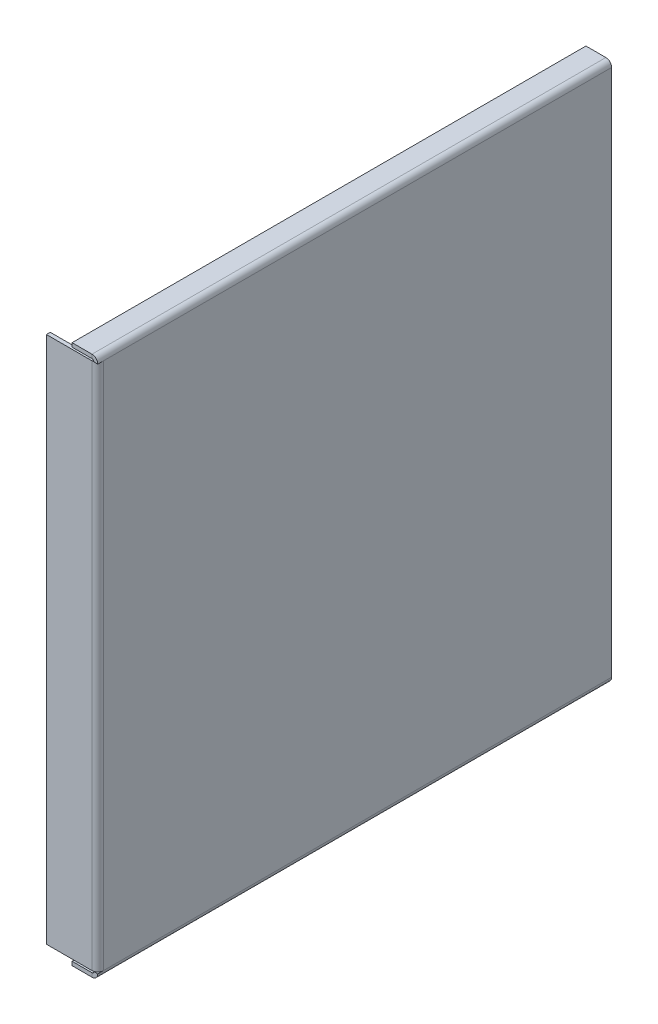
ISO-10303-21;
HEADER;
FILE_DESCRIPTION(('STEP AP214'),'2;1');
FILE_NAME('part.step','',(''),(''),'','','');
FILE_SCHEMA(('AUTOMOTIVE_DESIGN { 1 0 10303 214 1 1 1 1 }'));
ENDSEC;
DATA;
#1=APPLICATION_CONTEXT('core data for automotive mechanical design processes');
#2=APPLICATION_PROTOCOL_DEFINITION('international standard','automotive_design',2000,#1);
#3=PRODUCT_CONTEXT('',#1,'mechanical');
#4=PRODUCT('Part','Part','',(#3));
#5=PRODUCT_RELATED_PRODUCT_CATEGORY('part','',(#4));
#6=PRODUCT_DEFINITION_FORMATION('','',#4);
#7=PRODUCT_DEFINITION_CONTEXT('part definition',#1,'design');
#8=PRODUCT_DEFINITION('design','',#6,#7);
#9=PRODUCT_DEFINITION_SHAPE('','',#8);
#10=(LENGTH_UNIT() NAMED_UNIT(*) SI_UNIT(.MILLI.,.METRE.));
#11=(NAMED_UNIT(*) PLANE_ANGLE_UNIT() SI_UNIT($,.RADIAN.));
#12=(NAMED_UNIT(*) SI_UNIT($,.STERADIAN.) SOLID_ANGLE_UNIT());
#13=UNCERTAINTY_MEASURE_WITH_UNIT(LENGTH_MEASURE(1.E-05),#10,'distance_accuracy_value','');
#14=(GEOMETRIC_REPRESENTATION_CONTEXT(3) GLOBAL_UNCERTAINTY_ASSIGNED_CONTEXT((#13)) GLOBAL_UNIT_ASSIGNED_CONTEXT((#10,
#11,#12)) REPRESENTATION_CONTEXT('',''));
#15=CARTESIAN_POINT('',(0.,0.,0.));
#16=DIRECTION('',(0.,0.,1.));
#17=DIRECTION('',(1.,0.,0.));
#18=AXIS2_PLACEMENT_3D('',#15,#16,#17);
#19=CARTESIAN_POINT('',(0.,207.7634,200.));
#20=DIRECTION('',(0.,-1.,0.));
#21=DIRECTION('',(0.,0.,-1.));
#22=AXIS2_PLACEMENT_3D('',#19,#20,#21);
#23=PLANE('',#22);
#24=DIRECTION('',(0.,0.,-1.));
#25=VECTOR('',#24,1.);
#26=CARTESIAN_POINT('',(0.,207.7634,200.));
#27=LINE('',#26,#25);
#28=CARTESIAN_POINT('',(0.,207.7634,200.));
#29=VERTEX_POINT('',#28);
#30=CARTESIAN_POINT('',(0.,207.7634,199.875223856291));
#31=VERTEX_POINT('',#30);
#32=EDGE_CURVE('E296',#29,#31,#27,.T.);
#33=ORIENTED_EDGE('',*,*,#32,.T.);
#34=CARTESIAN_POINT('',(-0.736600000000004,207.7634,197.7634));
#35=DIRECTION('',(0.,1.,0.));
#36=DIRECTION('',(0.,0.,1.));
#37=AXIS2_PLACEMENT_3D('',#34,#35,#36);
#38=CIRCLE('',#37,2.2366);
#39=CARTESIAN_POINT('',(1.5,207.7634,197.7634));
#40=VERTEX_POINT('',#39);
#41=EDGE_CURVE('E13',#31,#40,#38,.T.);
#42=ORIENTED_EDGE('',*,*,#41,.T.);
#43=DIRECTION('',(0.,0.,-1.));
#44=VECTOR('',#43,1.);
#45=CARTESIAN_POINT('',(1.5,207.7634,0.));
#46=LINE('',#45,#44);
#47=CARTESIAN_POINT('',(1.5,207.7634,200.));
#48=VERTEX_POINT('',#47);
#49=EDGE_CURVE('E299',#48,#40,#46,.T.);
#50=ORIENTED_EDGE('',*,*,#49,.F.);
#51=DIRECTION('',(1.,0.,0.));
#52=VECTOR('',#51,1.);
#53=CARTESIAN_POINT('',(0.,207.7634,200.));
#54=LINE('',#53,#52);
#55=EDGE_CURVE('E409',#29,#48,#54,.T.);
#56=ORIENTED_EDGE('',*,*,#55,.F.);
#57=EDGE_LOOP('',(#33,#42,#50,#56));
#58=FACE_BOUND('',#57,.T.);
#59=ADVANCED_FACE('F99',(#58),#23,.T.);
#60=CARTESIAN_POINT('',(0.,2.23659999999998,197.7634));
#61=DIRECTION('',(0.,1.,0.));
#62=DIRECTION('',(0.,0.,1.));
#63=AXIS2_PLACEMENT_3D('',#60,#61,#62);
#64=PLANE('',#63);
#65=DIRECTION('',(0.,0.,1.));
#66=VECTOR('',#65,1.);
#67=CARTESIAN_POINT('',(1.5,2.2366,200.));
#68=LINE('',#67,#66);
#69=CARTESIAN_POINT('',(1.5,2.2366,200.));
#70=VERTEX_POINT('',#69);
#71=CARTESIAN_POINT('',(1.5,2.23659999999998,197.7634));
#72=VERTEX_POINT('',#71);
#73=EDGE_CURVE('E335',#70,#72,#68,.F.);
#74=ORIENTED_EDGE('',*,*,#73,.T.);
#75=CARTESIAN_POINT('',(-0.736600000000004,2.23659999999998,197.7634));
#76=DIRECTION('',(0.,1.,0.));
#77=DIRECTION('',(0.,0.,1.));
#78=AXIS2_PLACEMENT_3D('',#75,#76,#77);
#79=CIRCLE('',#78,2.2366);
#80=CARTESIAN_POINT('',(0.,2.23659999999998,199.875223856291));
#81=VERTEX_POINT('',#80);
#82=EDGE_CURVE('E288',#72,#81,#79,.F.);
#83=ORIENTED_EDGE('',*,*,#82,.T.);
#84=DIRECTION('',(0.,0.,1.));
#85=VECTOR('',#84,1.);
#86=CARTESIAN_POINT('',(0.,2.2366,200.));
#87=LINE('',#86,#85);
#88=CARTESIAN_POINT('',(0.,2.2366,200.));
#89=VERTEX_POINT('',#88);
#90=EDGE_CURVE('E348',#89,#81,#87,.F.);
#91=ORIENTED_EDGE('',*,*,#90,.F.);
#92=DIRECTION('',(1.,0.,0.));
#93=VECTOR('',#92,1.);
#94=CARTESIAN_POINT('',(0.,2.2366,200.));
#95=LINE('',#94,#93);
#96=EDGE_CURVE('E342',#89,#70,#95,.T.);
#97=ORIENTED_EDGE('',*,*,#96,.T.);
#98=EDGE_LOOP('',(#74,#83,#91,#97));
#99=FACE_BOUND('',#98,.T.);
#100=ADVANCED_FACE('F479',(#99),#64,.T.);
#101=CARTESIAN_POINT('',(1.5,0.,200.));
#102=DIRECTION('',(-1.,0.,0.));
#103=DIRECTION('',(0.,0.,1.));
#104=AXIS2_PLACEMENT_3D('',#101,#102,#103);
#105=PLANE('',#104);
#106=DIRECTION('',(0.,1.,0.));
#107=VECTOR('',#106,1.);
#108=CARTESIAN_POINT('',(1.5,207.7634,197.7634));
#109=LINE('',#108,#107);
#110=EDGE_CURVE('E242',#40,#72,#109,.F.);
#111=ORIENTED_EDGE('',*,*,#110,.T.);
#112=CARTESIAN_POINT('',(1.5,2.2366,0.));
#113=VERTEX_POINT('',#112);
#114=EDGE_CURVE('E339',#72,#113,#68,.F.);
#115=ORIENTED_EDGE('',*,*,#114,.T.);
#116=DIRECTION('',(0.,1.,0.));
#117=VECTOR('',#116,1.);
#118=CARTESIAN_POINT('',(1.5,0.,0.));
#119=LINE('',#118,#117);
#120=CARTESIAN_POINT('',(1.5,207.7634,0.));
#121=VERTEX_POINT('',#120);
#122=EDGE_CURVE('E412',#113,#121,#119,.T.);
#123=ORIENTED_EDGE('',*,*,#122,.T.);
#124=DIRECTION('',(0.,0.,-1.));
#125=VECTOR('',#124,1.);
#126=CARTESIAN_POINT('',(1.5,207.7634,0.));
#127=LINE('',#126,#125);
#128=EDGE_CURVE('E391',#121,#40,#127,.F.);
#129=ORIENTED_EDGE('',*,*,#128,.T.);
#130=EDGE_LOOP('',(#111,#115,#123,#129));
#131=FACE_BOUND('',#130,.T.);
#132=ADVANCED_FACE('F101',(#131),#105,.F.);
#133=CARTESIAN_POINT('',(0.,0.,200.));
#134=DIRECTION('',(-1.,0.,0.));
#135=DIRECTION('',(0.,0.,1.));
#136=AXIS2_PLACEMENT_3D('',#133,#134,#135);
#137=PLANE('',#136);
#138=CARTESIAN_POINT('',(0.,2.2366,197.7634));
#139=VERTEX_POINT('',#138);
#140=CARTESIAN_POINT('',(0.,2.2366,0.));
#141=VERTEX_POINT('',#140);
#142=EDGE_CURVE('E124',#139,#141,#87,.F.);
#143=ORIENTED_EDGE('',*,*,#142,.F.);
#144=DIRECTION('',(0.,1.,0.));
#145=VECTOR('',#144,1.);
#146=CARTESIAN_POINT('',(0.,207.7634,197.7634));
#147=LINE('',#146,#145);
#148=CARTESIAN_POINT('',(0.,207.7634,197.7634));
#149=VERTEX_POINT('',#148);
#150=EDGE_CURVE('E293',#149,#139,#147,.F.);
#151=ORIENTED_EDGE('',*,*,#150,.F.);
#152=DIRECTION('',(0.,0.,-1.));
#153=VECTOR('',#152,1.);
#154=CARTESIAN_POINT('',(0.,207.7634,0.));
#155=LINE('',#154,#153);
#156=CARTESIAN_POINT('',(0.,207.7634,0.));
#157=VERTEX_POINT('',#156);
#158=EDGE_CURVE('E404',#157,#149,#155,.F.);
#159=ORIENTED_EDGE('',*,*,#158,.F.);
#160=DIRECTION('',(0.,1.,0.));
#161=VECTOR('',#160,1.);
#162=CARTESIAN_POINT('',(0.,0.,0.));
#163=LINE('',#162,#161);
#164=EDGE_CURVE('E103',#141,#157,#163,.T.);
#165=ORIENTED_EDGE('',*,*,#164,.F.);
#166=EDGE_LOOP('',(#143,#151,#159,#165));
#167=FACE_BOUND('',#166,.T.);
#168=ADVANCED_FACE('F425',(#167),#137,.T.);
#169=CARTESIAN_POINT('',(0.,0.,0.));
#170=DIRECTION('',(0.,0.,-1.));
#171=DIRECTION('',(-1.,0.,0.));
#172=AXIS2_PLACEMENT_3D('',#169,#170,#171);
#173=PLANE('',#172);
#174=DIRECTION('',(1.,0.,0.));
#175=VECTOR('',#174,1.);
#176=CARTESIAN_POINT('',(0.,2.2366,0.));
#177=LINE('',#176,#175);
#178=EDGE_CURVE('E354',#141,#113,#177,.T.);
#179=ORIENTED_EDGE('',*,*,#178,.F.);
#180=ORIENTED_EDGE('',*,*,#164,.T.);
#181=DIRECTION('',(1.,0.,0.));
#182=VECTOR('',#181,1.);
#183=CARTESIAN_POINT('',(0.,207.7634,0.));
#184=LINE('',#183,#182);
#185=EDGE_CURVE('E398',#157,#121,#184,.T.);
#186=ORIENTED_EDGE('',*,*,#185,.T.);
#187=ORIENTED_EDGE('',*,*,#122,.F.);
#188=EDGE_LOOP('',(#179,#180,#186,#187));
#189=FACE_BOUND('',#188,.T.);
#190=ADVANCED_FACE('F419',(#189),#173,.T.);
#191=CARTESIAN_POINT('',(-0.736600000000006,207.7634,200.));
#192=DIRECTION('',(0.,0.,1.));
#193=DIRECTION('',(1.,0.,0.));
#194=AXIS2_PLACEMENT_3D('',#191,#192,#193);
#195=PLANE('',#194);
#196=DIRECTION('',(0.,1.,0.));
#197=VECTOR('',#196,1.);
#198=CARTESIAN_POINT('',(-0.736599999999999,210.,200.));
#199=LINE('',#198,#197);
#200=CARTESIAN_POINT('',(-0.736600000000004,208.5,200.));
#201=VERTEX_POINT('',#200);
#202=CARTESIAN_POINT('',(-0.736599999999999,210.,200.));
#203=VERTEX_POINT('',#202);
#204=EDGE_CURVE('E357',#201,#203,#199,.T.);
#205=ORIENTED_EDGE('',*,*,#204,.F.);
#206=CARTESIAN_POINT('',(-0.736600000000006,207.7634,200.));
#207=DIRECTION('',(0.,0.,-1.));
#208=DIRECTION('',(-1.,0.,0.));
#209=AXIS2_PLACEMENT_3D('',#206,#207,#208);
#210=CIRCLE('',#209,0.736600000000004);
#211=EDGE_CURVE('E401',#29,#201,#210,.F.);
#212=ORIENTED_EDGE('',*,*,#211,.F.);
#213=ORIENTED_EDGE('',*,*,#55,.T.);
#214=CARTESIAN_POINT('',(-0.736600000000006,207.7634,200.));
#215=DIRECTION('',(0.,0.,-1.));
#216=DIRECTION('',(-1.,0.,0.));
#217=AXIS2_PLACEMENT_3D('',#214,#215,#216);
#218=CIRCLE('',#217,2.2366);
#219=EDGE_CURVE('E394',#48,#203,#218,.F.);
#220=ORIENTED_EDGE('',*,*,#219,.T.);
#221=EDGE_LOOP('',(#205,#212,#213,#220));
#222=FACE_BOUND('',#221,.T.);
#223=ADVANCED_FACE('F456',(#222),#195,.T.);
#224=CARTESIAN_POINT('',(-0.736600000000006,207.7634,0.));
#225=DIRECTION('',(0.,0.,1.));
#226=DIRECTION('',(1.,0.,0.));
#227=AXIS2_PLACEMENT_3D('',#224,#225,#226);
#228=PLANE('',#227);
#229=CARTESIAN_POINT('',(-0.736600000000006,207.7634,0.));
#230=DIRECTION('',(0.,0.,-1.));
#231=DIRECTION('',(-1.,0.,0.));
#232=AXIS2_PLACEMENT_3D('',#229,#230,#231);
#233=CIRCLE('',#232,0.736600000000004);
#234=CARTESIAN_POINT('',(-0.736600000000004,208.5,0.));
#235=VERTEX_POINT('',#234);
#236=EDGE_CURVE('E361',#235,#157,#233,.T.);
#237=ORIENTED_EDGE('',*,*,#236,.F.);
#238=DIRECTION('',(0.,1.,0.));
#239=VECTOR('',#238,1.);
#240=CARTESIAN_POINT('',(-0.736600000000004,208.5,0.));
#241=LINE('',#240,#239);
#242=CARTESIAN_POINT('',(-0.736599999999999,210.,0.));
#243=VERTEX_POINT('',#242);
#244=EDGE_CURVE('E384',#235,#243,#241,.T.);
#245=ORIENTED_EDGE('',*,*,#244,.T.);
#246=CARTESIAN_POINT('',(-0.736600000000006,207.7634,0.));
#247=DIRECTION('',(0.,0.,-1.));
#248=DIRECTION('',(-1.,0.,0.));
#249=AXIS2_PLACEMENT_3D('',#246,#247,#248);
#250=CIRCLE('',#249,2.2366);
#251=EDGE_CURVE('E395',#243,#121,#250,.T.);
#252=ORIENTED_EDGE('',*,*,#251,.T.);
#253=ORIENTED_EDGE('',*,*,#185,.F.);
#254=EDGE_LOOP('',(#237,#245,#252,#253));
#255=FACE_BOUND('',#254,.T.);
#256=ADVANCED_FACE('F429',(#255),#228,.F.);
#257=CARTESIAN_POINT('',(-0.736600000000006,207.7634,0.));
#258=DIRECTION('',(0.,0.,-1.));
#259=DIRECTION('',(0.,1.,0.));
#260=AXIS2_PLACEMENT_3D('',#257,#258,#259);
#261=CYLINDRICAL_SURFACE('',#260,2.2366);
#262=ORIENTED_EDGE('',*,*,#128,.F.);
#263=ORIENTED_EDGE('',*,*,#251,.F.);
#264=DIRECTION('',(0.,0.,-1.));
#265=VECTOR('',#264,1.);
#266=CARTESIAN_POINT('',(-0.736599999999999,210.,0.));
#267=LINE('',#266,#265);
#268=EDGE_CURVE('E381',#203,#243,#267,.T.);
#269=ORIENTED_EDGE('',*,*,#268,.F.);
#270=ORIENTED_EDGE('',*,*,#219,.F.);
#271=ORIENTED_EDGE('',*,*,#49,.T.);
#272=EDGE_LOOP('',(#262,#263,#269,#270,#271));
#273=FACE_BOUND('',#272,.T.);
#274=ADVANCED_FACE('F454',(#273),#261,.T.);
#275=CARTESIAN_POINT('',(-0.736600000000006,207.7634,0.));
#276=DIRECTION('',(0.,0.,-1.));
#277=DIRECTION('',(0.,1.,0.));
#278=AXIS2_PLACEMENT_3D('',#275,#276,#277);
#279=CYLINDRICAL_SURFACE('',#278,0.736600000000004);
#280=ORIENTED_EDGE('',*,*,#158,.T.);
#281=EDGE_CURVE('E290',#31,#149,#27,.T.);
#282=ORIENTED_EDGE('',*,*,#281,.F.);
#283=ORIENTED_EDGE('',*,*,#32,.F.);
#284=ORIENTED_EDGE('',*,*,#211,.T.);
#285=DIRECTION('',(0.,0.,1.));
#286=VECTOR('',#285,1.);
#287=CARTESIAN_POINT('',(-0.736600000000004,208.5,200.));
#288=LINE('',#287,#286);
#289=EDGE_CURVE('E387',#201,#235,#288,.F.);
#290=ORIENTED_EDGE('',*,*,#289,.T.);
#291=ORIENTED_EDGE('',*,*,#236,.T.);
#292=EDGE_LOOP('',(#280,#282,#283,#284,#290,#291));
#293=FACE_BOUND('',#292,.T.);
#294=ADVANCED_FACE('F430',(#293),#279,.F.);
#295=CARTESIAN_POINT('',(0.,210.,0.));
#296=DIRECTION('',(0.,0.,-1.));
#297=DIRECTION('',(-1.,0.,0.));
#298=AXIS2_PLACEMENT_3D('',#295,#296,#297);
#299=PLANE('',#298);
#300=DIRECTION('',(1.,0.,0.));
#301=VECTOR('',#300,1.);
#302=CARTESIAN_POINT('',(0.,210.,0.));
#303=LINE('',#302,#301);
#304=CARTESIAN_POINT('',(-8.5,210.,0.));
#305=VERTEX_POINT('',#304);
#306=EDGE_CURVE('E365',#305,#243,#303,.T.);
#307=ORIENTED_EDGE('',*,*,#306,.T.);
#308=ORIENTED_EDGE('',*,*,#244,.F.);
#309=DIRECTION('',(-1.,0.,0.));
#310=VECTOR('',#309,1.);
#311=CARTESIAN_POINT('',(6.8572598579789E-13,208.5,0.));
#312=LINE('',#311,#310);
#313=CARTESIAN_POINT('',(-8.50000000000001,208.5,0.));
#314=VERTEX_POINT('',#313);
#315=EDGE_CURVE('E373',#314,#235,#312,.F.);
#316=ORIENTED_EDGE('',*,*,#315,.F.);
#317=DIRECTION('',(0.,-1.,0.));
#318=VECTOR('',#317,1.);
#319=CARTESIAN_POINT('',(-8.5,210.,0.));
#320=LINE('',#319,#318);
#321=EDGE_CURVE('E359',#305,#314,#320,.T.);
#322=ORIENTED_EDGE('',*,*,#321,.F.);
#323=EDGE_LOOP('',(#307,#308,#316,#322));
#324=FACE_BOUND('',#323,.T.);
#325=ADVANCED_FACE('F448',(#324),#299,.T.);
#326=CARTESIAN_POINT('',(-8.5,210.,200.));
#327=DIRECTION('',(0.,0.,1.));
#328=DIRECTION('',(1.,0.,0.));
#329=AXIS2_PLACEMENT_3D('',#326,#327,#328);
#330=PLANE('',#329);
#331=DIRECTION('',(1.,0.,0.));
#332=VECTOR('',#331,1.);
#333=CARTESIAN_POINT('',(6.8572598579789E-13,208.5,200.));
#334=LINE('',#333,#332);
#335=CARTESIAN_POINT('',(-8.50000000000001,208.5,200.));
#336=VERTEX_POINT('',#335);
#337=EDGE_CURVE('E379',#201,#336,#334,.F.);
#338=ORIENTED_EDGE('',*,*,#337,.F.);
#339=ORIENTED_EDGE('',*,*,#204,.T.);
#340=DIRECTION('',(-1.,0.,0.));
#341=VECTOR('',#340,1.);
#342=CARTESIAN_POINT('',(-8.5,210.,200.));
#343=LINE('',#342,#341);
#344=CARTESIAN_POINT('',(-8.5,210.,200.));
#345=VERTEX_POINT('',#344);
#346=EDGE_CURVE('E371',#203,#345,#343,.T.);
#347=ORIENTED_EDGE('',*,*,#346,.T.);
#348=DIRECTION('',(0.,-1.,0.));
#349=VECTOR('',#348,1.);
#350=CARTESIAN_POINT('',(-8.5,210.,200.));
#351=LINE('',#350,#349);
#352=EDGE_CURVE('E362',#345,#336,#351,.T.);
#353=ORIENTED_EDGE('',*,*,#352,.T.);
#354=EDGE_LOOP('',(#338,#339,#347,#353));
#355=FACE_BOUND('',#354,.T.);
#356=ADVANCED_FACE('F440',(#355),#330,.T.);
#357=CARTESIAN_POINT('',(6.90963207806155E-13,210.,0.));
#358=DIRECTION('',(0.,1.,0.));
#359=DIRECTION('',(-1.,0.,0.));
#360=AXIS2_PLACEMENT_3D('',#357,#358,#359);
#361=PLANE('',#360);
#362=ORIENTED_EDGE('',*,*,#346,.F.);
#363=ORIENTED_EDGE('',*,*,#268,.T.);
#364=ORIENTED_EDGE('',*,*,#306,.F.);
#365=DIRECTION('',(0.,0.,-1.));
#366=VECTOR('',#365,1.);
#367=CARTESIAN_POINT('',(-8.5,210.,0.));
#368=LINE('',#367,#366);
#369=EDGE_CURVE('E368',#345,#305,#368,.T.);
#370=ORIENTED_EDGE('',*,*,#369,.F.);
#371=EDGE_LOOP('',(#362,#363,#364,#370));
#372=FACE_BOUND('',#371,.T.);
#373=ADVANCED_FACE('F451',(#372),#361,.T.);
#374=CARTESIAN_POINT('',(6.8572598579789E-13,208.5,0.));
#375=DIRECTION('',(0.,1.,0.));
#376=DIRECTION('',(-1.,0.,0.));
#377=AXIS2_PLACEMENT_3D('',#374,#375,#376);
#378=PLANE('',#377);
#379=ORIENTED_EDGE('',*,*,#289,.F.);
#380=ORIENTED_EDGE('',*,*,#337,.T.);
#381=DIRECTION('',(0.,0.,1.));
#382=VECTOR('',#381,1.);
#383=CARTESIAN_POINT('',(-8.50000000000001,208.5,0.));
#384=LINE('',#383,#382);
#385=EDGE_CURVE('E376',#336,#314,#384,.F.);
#386=ORIENTED_EDGE('',*,*,#385,.T.);
#387=ORIENTED_EDGE('',*,*,#315,.T.);
#388=EDGE_LOOP('',(#379,#380,#386,#387));
#389=FACE_BOUND('',#388,.T.);
#390=ADVANCED_FACE('F436',(#389),#378,.F.);
#391=CARTESIAN_POINT('',(-8.5,210.,0.));
#392=DIRECTION('',(-1.,0.,0.));
#393=DIRECTION('',(0.,-1.,0.));
#394=AXIS2_PLACEMENT_3D('',#391,#392,#393);
#395=PLANE('',#394);
#396=ORIENTED_EDGE('',*,*,#385,.F.);
#397=ORIENTED_EDGE('',*,*,#352,.F.);
#398=ORIENTED_EDGE('',*,*,#369,.T.);
#399=ORIENTED_EDGE('',*,*,#321,.T.);
#400=EDGE_LOOP('',(#396,#397,#398,#399));
#401=FACE_BOUND('',#400,.T.);
#402=ADVANCED_FACE('F446',(#401),#395,.T.);
#403=CARTESIAN_POINT('',(-0.7366,2.2366,0.));
#404=DIRECTION('',(0.,0.,-1.));
#405=DIRECTION('',(-1.,0.,0.));
#406=AXIS2_PLACEMENT_3D('',#403,#404,#405);
#407=PLANE('',#406);
#408=DIRECTION('',(0.,-1.,0.));
#409=VECTOR('',#408,1.);
#410=CARTESIAN_POINT('',(-0.736599999999992,0.,0.));
#411=LINE('',#410,#409);
#412=CARTESIAN_POINT('',(-0.736599999999997,1.5,0.));
#413=VERTEX_POINT('',#412);
#414=CARTESIAN_POINT('',(-0.736599999999992,0.,0.));
#415=VERTEX_POINT('',#414);
#416=EDGE_CURVE('E302',#413,#415,#411,.T.);
#417=ORIENTED_EDGE('',*,*,#416,.F.);
#418=CARTESIAN_POINT('',(-0.7366,2.2366,0.));
#419=DIRECTION('',(0.,0.,1.));
#420=DIRECTION('',(1.,0.,0.));
#421=AXIS2_PLACEMENT_3D('',#418,#419,#420);
#422=CIRCLE('',#421,0.7366);
#423=EDGE_CURVE('E346',#141,#413,#422,.F.);
#424=ORIENTED_EDGE('',*,*,#423,.F.);
#425=ORIENTED_EDGE('',*,*,#178,.T.);
#426=CARTESIAN_POINT('',(-0.7366,2.2366,0.));
#427=DIRECTION('',(0.,0.,1.));
#428=DIRECTION('',(1.,0.,0.));
#429=AXIS2_PLACEMENT_3D('',#426,#427,#428);
#430=CIRCLE('',#429,2.2366);
#431=EDGE_CURVE('E338',#113,#415,#430,.F.);
#432=ORIENTED_EDGE('',*,*,#431,.T.);
#433=EDGE_LOOP('',(#417,#424,#425,#432));
#434=FACE_BOUND('',#433,.T.);
#435=ADVANCED_FACE('F518',(#434),#407,.T.);
#436=CARTESIAN_POINT('',(-0.7366,2.2366,200.));
#437=DIRECTION('',(0.,0.,-1.));
#438=DIRECTION('',(-1.,0.,0.));
#439=AXIS2_PLACEMENT_3D('',#436,#437,#438);
#440=PLANE('',#439);
#441=CARTESIAN_POINT('',(-0.7366,2.2366,200.));
#442=DIRECTION('',(0.,0.,1.));
#443=DIRECTION('',(1.,0.,0.));
#444=AXIS2_PLACEMENT_3D('',#441,#442,#443);
#445=CIRCLE('',#444,0.7366);
#446=CARTESIAN_POINT('',(-0.736599999999997,1.5,200.));
#447=VERTEX_POINT('',#446);
#448=EDGE_CURVE('E305',#447,#89,#445,.T.);
#449=ORIENTED_EDGE('',*,*,#448,.F.);
#450=DIRECTION('',(0.,-1.,0.));
#451=VECTOR('',#450,1.);
#452=CARTESIAN_POINT('',(-0.736599999999997,1.5,200.));
#453=LINE('',#452,#451);
#454=CARTESIAN_POINT('',(-0.736599999999992,0.,200.));
#455=VERTEX_POINT('',#454);
#456=EDGE_CURVE('E328',#447,#455,#453,.T.);
#457=ORIENTED_EDGE('',*,*,#456,.T.);
#458=CARTESIAN_POINT('',(-0.7366,2.2366,200.));
#459=DIRECTION('',(0.,0.,1.));
#460=DIRECTION('',(1.,0.,0.));
#461=AXIS2_PLACEMENT_3D('',#458,#459,#460);
#462=CIRCLE('',#461,2.2366);
#463=EDGE_CURVE('E343',#455,#70,#462,.T.);
#464=ORIENTED_EDGE('',*,*,#463,.T.);
#465=ORIENTED_EDGE('',*,*,#96,.F.);
#466=EDGE_LOOP('',(#449,#457,#464,#465));
#467=FACE_BOUND('',#466,.T.);
#468=ADVANCED_FACE('F514',(#467),#440,.F.);
#469=CARTESIAN_POINT('',(-0.7366,2.2366,200.));
#470=DIRECTION('',(0.,0.,1.));
#471=DIRECTION('',(0.,-1.,0.));
#472=AXIS2_PLACEMENT_3D('',#469,#470,#471);
#473=CYLINDRICAL_SURFACE('',#472,2.2366);
#474=ORIENTED_EDGE('',*,*,#73,.F.);
#475=ORIENTED_EDGE('',*,*,#463,.F.);
#476=DIRECTION('',(0.,0.,1.));
#477=VECTOR('',#476,1.);
#478=CARTESIAN_POINT('',(-0.736599999999992,0.,0.));
#479=LINE('',#478,#477);
#480=EDGE_CURVE('E325',#415,#455,#479,.T.);
#481=ORIENTED_EDGE('',*,*,#480,.F.);
#482=ORIENTED_EDGE('',*,*,#431,.F.);
#483=ORIENTED_EDGE('',*,*,#114,.F.);
#484=EDGE_LOOP('',(#474,#475,#481,#482,#483));
#485=FACE_BOUND('',#484,.T.);
#486=ADVANCED_FACE('F511',(#485),#473,.T.);
#487=CARTESIAN_POINT('',(-0.7366,2.2366,200.));
#488=DIRECTION('',(0.,0.,1.));
#489=DIRECTION('',(0.,-1.,0.));
#490=AXIS2_PLACEMENT_3D('',#487,#488,#489);
#491=CYLINDRICAL_SURFACE('',#490,0.7366);
#492=ORIENTED_EDGE('',*,*,#90,.T.);
#493=EDGE_CURVE('E351',#81,#139,#87,.F.);
#494=ORIENTED_EDGE('',*,*,#493,.T.);
#495=ORIENTED_EDGE('',*,*,#142,.T.);
#496=ORIENTED_EDGE('',*,*,#423,.T.);
#497=DIRECTION('',(0.,0.,-1.));
#498=VECTOR('',#497,1.);
#499=CARTESIAN_POINT('',(-0.736599999999997,1.5,0.));
#500=LINE('',#499,#498);
#501=EDGE_CURVE('E331',#413,#447,#500,.F.);
#502=ORIENTED_EDGE('',*,*,#501,.T.);
#503=ORIENTED_EDGE('',*,*,#448,.T.);
#504=EDGE_LOOP('',(#492,#494,#495,#496,#502,#503));
#505=FACE_BOUND('',#504,.T.);
#506=ADVANCED_FACE('F502',(#505),#491,.F.);
#507=CARTESIAN_POINT('',(0.,0.,200.));
#508=DIRECTION('',(0.,0.,1.));
#509=DIRECTION('',(1.,0.,0.));
#510=AXIS2_PLACEMENT_3D('',#507,#508,#509);
#511=PLANE('',#510);
#512=DIRECTION('',(1.,0.,0.));
#513=VECTOR('',#512,1.);
#514=CARTESIAN_POINT('',(0.,0.,200.));
#515=LINE('',#514,#513);
#516=CARTESIAN_POINT('',(-8.5,0.,200.));
#517=VERTEX_POINT('',#516);
#518=EDGE_CURVE('E309',#517,#455,#515,.T.);
#519=ORIENTED_EDGE('',*,*,#518,.T.);
#520=ORIENTED_EDGE('',*,*,#456,.F.);
#521=DIRECTION('',(-1.,0.,0.));
#522=VECTOR('',#521,1.);
#523=CARTESIAN_POINT('',(0.,1.5,200.));
#524=LINE('',#523,#522);
#525=CARTESIAN_POINT('',(-8.50000000000001,1.49999999999997,200.));
#526=VERTEX_POINT('',#525);
#527=EDGE_CURVE('E317',#526,#447,#524,.F.);
#528=ORIENTED_EDGE('',*,*,#527,.F.);
#529=DIRECTION('',(0.,1.,0.));
#530=VECTOR('',#529,1.);
#531=CARTESIAN_POINT('',(-8.5,0.,200.));
#532=LINE('',#531,#530);
#533=EDGE_CURVE('E303',#517,#526,#532,.T.);
#534=ORIENTED_EDGE('',*,*,#533,.F.);
#535=EDGE_LOOP('',(#519,#520,#528,#534));
#536=FACE_BOUND('',#535,.T.);
#537=ADVANCED_FACE('F499',(#536),#511,.T.);
#538=CARTESIAN_POINT('',(-8.5,0.,0.));
#539=DIRECTION('',(0.,0.,-1.));
#540=DIRECTION('',(-1.,0.,0.));
#541=AXIS2_PLACEMENT_3D('',#538,#539,#540);
#542=PLANE('',#541);
#543=DIRECTION('',(1.,0.,0.));
#544=VECTOR('',#543,1.);
#545=CARTESIAN_POINT('',(0.,1.5,0.));
#546=LINE('',#545,#544);
#547=CARTESIAN_POINT('',(-8.50000000000001,1.49999999999997,0.));
#548=VERTEX_POINT('',#547);
#549=EDGE_CURVE('E323',#413,#548,#546,.F.);
#550=ORIENTED_EDGE('',*,*,#549,.F.);
#551=ORIENTED_EDGE('',*,*,#416,.T.);
#552=DIRECTION('',(-1.,0.,0.));
#553=VECTOR('',#552,1.);
#554=CARTESIAN_POINT('',(-8.5,0.,0.));
#555=LINE('',#554,#553);
#556=CARTESIAN_POINT('',(-8.5,0.,0.));
#557=VERTEX_POINT('',#556);
#558=EDGE_CURVE('E315',#415,#557,#555,.T.);
#559=ORIENTED_EDGE('',*,*,#558,.T.);
#560=DIRECTION('',(0.,1.,0.));
#561=VECTOR('',#560,1.);
#562=CARTESIAN_POINT('',(-8.5,0.,0.));
#563=LINE('',#562,#561);
#564=EDGE_CURVE('E306',#557,#548,#563,.T.);
#565=ORIENTED_EDGE('',*,*,#564,.T.);
#566=EDGE_LOOP('',(#550,#551,#559,#565));
#567=FACE_BOUND('',#566,.T.);
#568=ADVANCED_FACE('F493',(#567),#542,.T.);
#569=CARTESIAN_POINT('',(0.,0.,0.));
#570=DIRECTION('',(0.,-1.,0.));
#571=DIRECTION('',(1.,0.,0.));
#572=AXIS2_PLACEMENT_3D('',#569,#570,#571);
#573=PLANE('',#572);
#574=ORIENTED_EDGE('',*,*,#558,.F.);
#575=ORIENTED_EDGE('',*,*,#480,.T.);
#576=ORIENTED_EDGE('',*,*,#518,.F.);
#577=DIRECTION('',(0.,0.,1.));
#578=VECTOR('',#577,1.);
#579=CARTESIAN_POINT('',(-8.5,0.,200.));
#580=LINE('',#579,#578);
#581=EDGE_CURVE('E312',#557,#517,#580,.T.);
#582=ORIENTED_EDGE('',*,*,#581,.F.);
#583=EDGE_LOOP('',(#574,#575,#576,#582));
#584=FACE_BOUND('',#583,.T.);
#585=ADVANCED_FACE('F489',(#584),#573,.T.);
#586=CARTESIAN_POINT('',(0.,1.5,0.));
#587=DIRECTION('',(0.,-1.,0.));
#588=DIRECTION('',(1.,0.,0.));
#589=AXIS2_PLACEMENT_3D('',#586,#587,#588);
#590=PLANE('',#589);
#591=ORIENTED_EDGE('',*,*,#501,.F.);
#592=ORIENTED_EDGE('',*,*,#549,.T.);
#593=DIRECTION('',(0.,0.,-1.));
#594=VECTOR('',#593,1.);
#595=CARTESIAN_POINT('',(-8.50000000000001,1.49999999999997,0.));
#596=LINE('',#595,#594);
#597=EDGE_CURVE('E320',#548,#526,#596,.F.);
#598=ORIENTED_EDGE('',*,*,#597,.T.);
#599=ORIENTED_EDGE('',*,*,#527,.T.);
#600=EDGE_LOOP('',(#591,#592,#598,#599));
#601=FACE_BOUND('',#600,.T.);
#602=ADVANCED_FACE('F492',(#601),#590,.F.);
#603=CARTESIAN_POINT('',(-8.5,0.,200.));
#604=DIRECTION('',(-1.,0.,0.));
#605=DIRECTION('',(0.,-1.,0.));
#606=AXIS2_PLACEMENT_3D('',#603,#604,#605);
#607=PLANE('',#606);
#608=ORIENTED_EDGE('',*,*,#597,.F.);
#609=ORIENTED_EDGE('',*,*,#564,.F.);
#610=ORIENTED_EDGE('',*,*,#581,.T.);
#611=ORIENTED_EDGE('',*,*,#533,.T.);
#612=EDGE_LOOP('',(#608,#609,#610,#611));
#613=FACE_BOUND('',#612,.T.);
#614=ADVANCED_FACE('F497',(#613),#607,.T.);
#615=CARTESIAN_POINT('',(-0.736600000000004,2.23659999999998,197.7634));
#616=DIRECTION('',(0.,-1.,0.));
#617=DIRECTION('',(0.,0.,-1.));
#618=AXIS2_PLACEMENT_3D('',#615,#616,#617);
#619=PLANE('',#618);
#620=ORIENTED_EDGE('',*,*,#493,.F.);
#621=CARTESIAN_POINT('',(-0.736599999999997,2.23659999999998,200.));
#622=VERTEX_POINT('',#621);
#623=EDGE_CURVE('E287',#81,#622,#79,.F.);
#624=ORIENTED_EDGE('',*,*,#623,.T.);
#625=DIRECTION('',(0.,0.,1.));
#626=VECTOR('',#625,1.);
#627=CARTESIAN_POINT('',(-0.736600000000004,2.2366,200.));
#628=LINE('',#627,#626);
#629=CARTESIAN_POINT('',(-0.736600000000002,2.23659999999998,198.5));
#630=VERTEX_POINT('',#629);
#631=EDGE_CURVE('E283',#630,#622,#628,.T.);
#632=ORIENTED_EDGE('',*,*,#631,.F.);
#633=CARTESIAN_POINT('',(-0.736600000000004,2.23659999999998,197.7634));
#634=DIRECTION('',(0.,1.,0.));
#635=DIRECTION('',(0.,0.,1.));
#636=AXIS2_PLACEMENT_3D('',#633,#634,#635);
#637=CIRCLE('',#636,0.736600000000004);
#638=EDGE_CURVE('E116',#139,#630,#637,.F.);
#639=ORIENTED_EDGE('',*,*,#638,.F.);
#640=EDGE_LOOP('',(#620,#624,#632,#639));
#641=FACE_BOUND('',#640,.T.);
#642=ADVANCED_FACE('F506',(#641),#619,.T.);
#643=CARTESIAN_POINT('',(-0.736600000000004,207.7634,197.7634));
#644=DIRECTION('',(0.,-1.,0.));
#645=DIRECTION('',(0.,0.,-1.));
#646=AXIS2_PLACEMENT_3D('',#643,#644,#645);
#647=PLANE('',#646);
#648=CARTESIAN_POINT('',(-0.736600000000004,207.7634,200.));
#649=VERTEX_POINT('',#648);
#650=EDGE_CURVE('E109',#649,#31,#38,.T.);
#651=ORIENTED_EDGE('',*,*,#650,.T.);
#652=ORIENTED_EDGE('',*,*,#281,.T.);
#653=CARTESIAN_POINT('',(-0.736600000000004,207.7634,197.7634));
#654=DIRECTION('',(0.,1.,0.));
#655=DIRECTION('',(0.,0.,1.));
#656=AXIS2_PLACEMENT_3D('',#653,#654,#655);
#657=CIRCLE('',#656,0.736600000000004);
#658=CARTESIAN_POINT('',(-0.736600000000002,207.7634,198.5));
#659=VERTEX_POINT('',#658);
#660=EDGE_CURVE('E248',#659,#149,#657,.T.);
#661=ORIENTED_EDGE('',*,*,#660,.F.);
#662=DIRECTION('',(0.,0.,1.));
#663=VECTOR('',#662,1.);
#664=CARTESIAN_POINT('',(-0.736600000000004,207.7634,198.5));
#665=LINE('',#664,#663);
#666=EDGE_CURVE('E245',#659,#649,#665,.T.);
#667=ORIENTED_EDGE('',*,*,#666,.T.);
#668=EDGE_LOOP('',(#651,#652,#661,#667));
#669=FACE_BOUND('',#668,.T.);
#670=ADVANCED_FACE('F246',(#669),#647,.F.);
#671=CARTESIAN_POINT('',(-0.736600000000004,207.7634,197.7634));
#672=DIRECTION('',(0.,1.,0.));
#673=DIRECTION('',(0.,0.,1.));
#674=AXIS2_PLACEMENT_3D('',#671,#672,#673);
#675=CYLINDRICAL_SURFACE('',#674,2.2366);
#676=ORIENTED_EDGE('',*,*,#110,.F.);
#677=ORIENTED_EDGE('',*,*,#41,.F.);
#678=ORIENTED_EDGE('',*,*,#650,.F.);
#679=DIRECTION('',(0.,1.,0.));
#680=VECTOR('',#679,1.);
#681=CARTESIAN_POINT('',(-0.736600000000004,0.,200.));
#682=LINE('',#681,#680);
#683=EDGE_CURVE('E238',#622,#649,#682,.T.);
#684=ORIENTED_EDGE('',*,*,#683,.F.);
#685=ORIENTED_EDGE('',*,*,#623,.F.);
#686=ORIENTED_EDGE('',*,*,#82,.F.);
#687=EDGE_LOOP('',(#676,#677,#678,#684,#685,#686));
#688=FACE_BOUND('',#687,.T.);
#689=ADVANCED_FACE('F235',(#688),#675,.T.);
#690=CARTESIAN_POINT('',(-0.736600000000004,207.7634,197.7634));
#691=DIRECTION('',(0.,1.,0.));
#692=DIRECTION('',(0.,0.,1.));
#693=AXIS2_PLACEMENT_3D('',#690,#691,#692);
#694=CYLINDRICAL_SURFACE('',#693,0.736600000000004);
#695=ORIENTED_EDGE('',*,*,#150,.T.);
#696=ORIENTED_EDGE('',*,*,#638,.T.);
#697=DIRECTION('',(0.,-1.,0.));
#698=VECTOR('',#697,1.);
#699=CARTESIAN_POINT('',(-0.736600000000004,2.2366,198.5));
#700=LINE('',#699,#698);
#701=EDGE_CURVE('E253',#630,#659,#700,.F.);
#702=ORIENTED_EDGE('',*,*,#701,.T.);
#703=ORIENTED_EDGE('',*,*,#660,.T.);
#704=EDGE_LOOP('',(#695,#696,#702,#703));
#705=FACE_BOUND('',#704,.T.);
#706=ADVANCED_FACE('F459',(#705),#694,.F.);
#707=CARTESIAN_POINT('',(0.,207.7634,200.));
#708=DIRECTION('',(0.,1.,0.));
#709=DIRECTION('',(0.,0.,1.));
#710=AXIS2_PLACEMENT_3D('',#707,#708,#709);
#711=PLANE('',#710);
#712=DIRECTION('',(1.,0.,0.));
#713=VECTOR('',#712,1.);
#714=CARTESIAN_POINT('',(0.,207.7634,200.));
#715=LINE('',#714,#713);
#716=CARTESIAN_POINT('',(-18.5,207.7634,200.));
#717=VERTEX_POINT('',#716);
#718=EDGE_CURVE('E260',#717,#649,#715,.T.);
#719=ORIENTED_EDGE('',*,*,#718,.T.);
#720=ORIENTED_EDGE('',*,*,#666,.F.);
#721=DIRECTION('',(-1.,0.,0.));
#722=VECTOR('',#721,1.);
#723=CARTESIAN_POINT('',(6.00120553851436E-13,207.7634,198.5));
#724=LINE('',#723,#722);
#725=CARTESIAN_POINT('',(-18.5,207.7634,198.5));
#726=VERTEX_POINT('',#725);
#727=EDGE_CURVE('E276',#726,#659,#724,.F.);
#728=ORIENTED_EDGE('',*,*,#727,.F.);
#729=DIRECTION('',(0.,0.,-1.));
#730=VECTOR('',#729,1.);
#731=CARTESIAN_POINT('',(-18.5,207.7634,200.));
#732=LINE('',#731,#730);
#733=EDGE_CURVE('E265',#717,#726,#732,.T.);
#734=ORIENTED_EDGE('',*,*,#733,.F.);
#735=EDGE_LOOP('',(#719,#720,#728,#734));
#736=FACE_BOUND('',#735,.T.);
#737=ADVANCED_FACE('F264',(#736),#711,.T.);
#738=CARTESIAN_POINT('',(-18.5,2.2366,200.));
#739=DIRECTION('',(0.,-1.,0.));
#740=DIRECTION('',(1.,0.,0.));
#741=AXIS2_PLACEMENT_3D('',#738,#739,#740);
#742=PLANE('',#741);
#743=DIRECTION('',(1.,0.,0.));
#744=VECTOR('',#743,1.);
#745=CARTESIAN_POINT('',(6.00172984696387E-13,2.2366,198.5));
#746=LINE('',#745,#744);
#747=CARTESIAN_POINT('',(-18.5,2.2366,198.5));
#748=VERTEX_POINT('',#747);
#749=EDGE_CURVE('E262',#630,#748,#746,.F.);
#750=ORIENTED_EDGE('',*,*,#749,.F.);
#751=ORIENTED_EDGE('',*,*,#631,.T.);
#752=DIRECTION('',(-1.,0.,0.));
#753=VECTOR('',#752,1.);
#754=CARTESIAN_POINT('',(-18.5,2.2366,200.));
#755=LINE('',#754,#753);
#756=CARTESIAN_POINT('',(-18.5,2.2366,200.));
#757=VERTEX_POINT('',#756);
#758=EDGE_CURVE('E261',#622,#757,#755,.T.);
#759=ORIENTED_EDGE('',*,*,#758,.T.);
#760=DIRECTION('',(0.,0.,-1.));
#761=VECTOR('',#760,1.);
#762=CARTESIAN_POINT('',(-18.5,2.2366,200.));
#763=LINE('',#762,#761);
#764=EDGE_CURVE('E267',#757,#748,#763,.T.);
#765=ORIENTED_EDGE('',*,*,#764,.T.);
#766=EDGE_LOOP('',(#750,#751,#759,#765));
#767=FACE_BOUND('',#766,.T.);
#768=ADVANCED_FACE('F465',(#767),#742,.T.);
#769=CARTESIAN_POINT('',(6.053577758597E-13,0.,200.));
#770=DIRECTION('',(0.,0.,1.));
#771=DIRECTION('',(1.,0.,0.));
#772=AXIS2_PLACEMENT_3D('',#769,#770,#771);
#773=PLANE('',#772);
#774=ORIENTED_EDGE('',*,*,#758,.F.);
#775=ORIENTED_EDGE('',*,*,#683,.T.);
#776=ORIENTED_EDGE('',*,*,#718,.F.);
#777=DIRECTION('',(0.,1.,0.));
#778=VECTOR('',#777,1.);
#779=CARTESIAN_POINT('',(-18.5,207.7634,200.));
#780=LINE('',#779,#778);
#781=EDGE_CURVE('E268',#757,#717,#780,.T.);
#782=ORIENTED_EDGE('',*,*,#781,.F.);
#783=EDGE_LOOP('',(#774,#775,#776,#782));
#784=FACE_BOUND('',#783,.T.);
#785=ADVANCED_FACE('F258',(#784),#773,.T.);
#786=CARTESIAN_POINT('',(6.00120553851436E-13,0.,198.5));
#787=DIRECTION('',(0.,0.,1.));
#788=DIRECTION('',(1.,0.,0.));
#789=AXIS2_PLACEMENT_3D('',#786,#787,#788);
#790=PLANE('',#789);
#791=ORIENTED_EDGE('',*,*,#701,.F.);
#792=ORIENTED_EDGE('',*,*,#749,.T.);
#793=DIRECTION('',(0.,-1.,0.));
#794=VECTOR('',#793,1.);
#795=CARTESIAN_POINT('',(-18.5,0.,198.5));
#796=LINE('',#795,#794);
#797=EDGE_CURVE('E278',#748,#726,#796,.F.);
#798=ORIENTED_EDGE('',*,*,#797,.T.);
#799=ORIENTED_EDGE('',*,*,#727,.T.);
#800=EDGE_LOOP('',(#791,#792,#798,#799));
#801=FACE_BOUND('',#800,.T.);
#802=ADVANCED_FACE('F463',(#801),#790,.F.);
#803=CARTESIAN_POINT('',(-18.5,207.7634,200.));
#804=DIRECTION('',(-1.,0.,0.));
#805=DIRECTION('',(0.,0.,1.));
#806=AXIS2_PLACEMENT_3D('',#803,#804,#805);
#807=PLANE('',#806);
#808=ORIENTED_EDGE('',*,*,#797,.F.);
#809=ORIENTED_EDGE('',*,*,#764,.F.);
#810=ORIENTED_EDGE('',*,*,#781,.T.);
#811=ORIENTED_EDGE('',*,*,#733,.T.);
#812=EDGE_LOOP('',(#808,#809,#810,#811));
#813=FACE_BOUND('',#812,.T.);
#814=ADVANCED_FACE('F469',(#813),#807,.T.);
#815=CLOSED_SHELL('',(#59,#100,#132,#168,#190,#223,#256,#274,#294,#325,#356,#373,#390,#402,#435,
#468,#486,#506,#537,#568,#585,#602,#614,#642,#670,#689,#706,#737,#768,#785,#802,#814));
#816=MANIFOLD_SOLID_BREP('B2',#815);
#817=ADVANCED_BREP_SHAPE_REPRESENTATION('',(#18,#816),#14);
#818=SHAPE_DEFINITION_REPRESENTATION(#9,#817);
ENDSEC;
END-ISO-10303-21;
